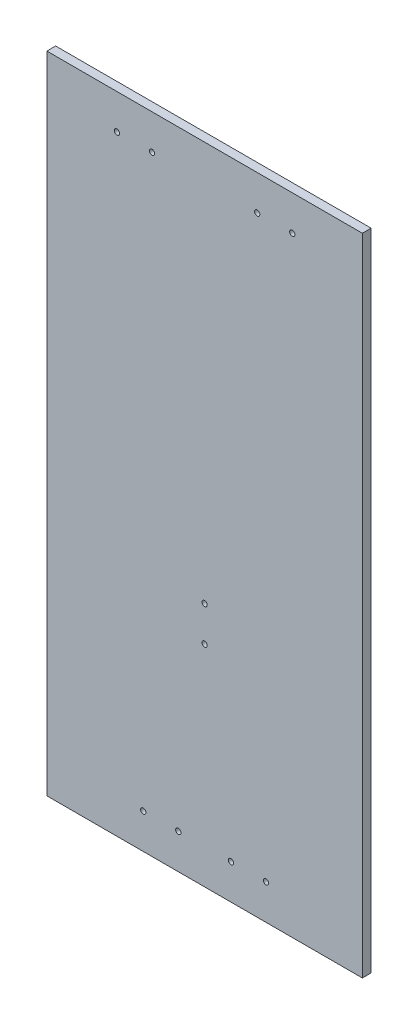
ISO-10303-21;
HEADER;
FILE_DESCRIPTION(('STEP AP214'),'2;1');
FILE_NAME('part.step','',(''),(''),'','','');
FILE_SCHEMA(('AUTOMOTIVE_DESIGN { 1 0 10303 214 1 1 1 1 }'));
ENDSEC;
DATA;
#1=APPLICATION_CONTEXT('core data for automotive mechanical design processes');
#2=APPLICATION_PROTOCOL_DEFINITION('international standard','automotive_design',2000,#1);
#3=PRODUCT_CONTEXT('',#1,'mechanical');
#4=PRODUCT('Part','Part','',(#3));
#5=PRODUCT_RELATED_PRODUCT_CATEGORY('part','',(#4));
#6=PRODUCT_DEFINITION_FORMATION('','',#4);
#7=PRODUCT_DEFINITION_CONTEXT('part definition',#1,'design');
#8=PRODUCT_DEFINITION('design','',#6,#7);
#9=PRODUCT_DEFINITION_SHAPE('','',#8);
#10=(LENGTH_UNIT() NAMED_UNIT(*) SI_UNIT(.MILLI.,.METRE.));
#11=(NAMED_UNIT(*) PLANE_ANGLE_UNIT() SI_UNIT($,.RADIAN.));
#12=(NAMED_UNIT(*) SI_UNIT($,.STERADIAN.) SOLID_ANGLE_UNIT());
#13=UNCERTAINTY_MEASURE_WITH_UNIT(LENGTH_MEASURE(1.E-05),#10,'distance_accuracy_value','');
#14=(GEOMETRIC_REPRESENTATION_CONTEXT(3) GLOBAL_UNCERTAINTY_ASSIGNED_CONTEXT((#13)) GLOBAL_UNIT_ASSIGNED_CONTEXT((#10,
#11,#12)) REPRESENTATION_CONTEXT('',''));
#15=CARTESIAN_POINT('',(0.,0.,0.));
#16=DIRECTION('',(0.,0.,1.));
#17=DIRECTION('',(1.,0.,0.));
#18=AXIS2_PLACEMENT_3D('',#15,#16,#17);
#19=CARTESIAN_POINT('',(0.,0.,5.));
#20=DIRECTION('',(0.,0.,-1.));
#21=DIRECTION('',(-1.,0.,0.));
#22=AXIS2_PLACEMENT_3D('',#19,#20,#21);
#23=PLANE('',#22);
#24=DIRECTION('',(0.,1.,0.));
#25=VECTOR('',#24,1.);
#26=CARTESIAN_POINT('',(90.,-184.,5.));
#27=LINE('',#26,#25);
#28=CARTESIAN_POINT('',(90.,-184.,5.));
#29=VERTEX_POINT('',#28);
#30=CARTESIAN_POINT('',(90.,184.,5.));
#31=VERTEX_POINT('',#30);
#32=EDGE_CURVE('E92',#29,#31,#27,.T.);
#33=ORIENTED_EDGE('',*,*,#32,.T.);
#34=DIRECTION('',(-1.,0.,0.));
#35=VECTOR('',#34,1.);
#36=CARTESIAN_POINT('',(-90.,184.,5.));
#37=LINE('',#36,#35);
#38=CARTESIAN_POINT('',(-90.,184.,5.));
#39=VERTEX_POINT('',#38);
#40=EDGE_CURVE('E87',#31,#39,#37,.T.);
#41=ORIENTED_EDGE('',*,*,#40,.T.);
#42=DIRECTION('',(0.,-1.,0.));
#43=VECTOR('',#42,1.);
#44=CARTESIAN_POINT('',(-90.,-184.,5.));
#45=LINE('',#44,#43);
#46=CARTESIAN_POINT('',(-90.,-184.,5.));
#47=VERTEX_POINT('',#46);
#48=EDGE_CURVE('E90',#39,#47,#45,.T.);
#49=ORIENTED_EDGE('',*,*,#48,.T.);
#50=DIRECTION('',(1.,0.,0.));
#51=VECTOR('',#50,1.);
#52=CARTESIAN_POINT('',(-90.,-184.,5.));
#53=LINE('',#52,#51);
#54=EDGE_CURVE('E57',#47,#29,#53,.T.);
#55=ORIENTED_EDGE('',*,*,#54,.T.);
#56=EDGE_LOOP('',(#33,#41,#49,#55));
#57=FACE_BOUND('',#56,.T.);
#58=CARTESIAN_POINT('',(15.,-164.,5.));
#59=DIRECTION('',(0.,0.,1.));
#60=DIRECTION('',(1.,0.,0.));
#61=AXIS2_PLACEMENT_3D('',#58,#59,#60);
#62=CIRCLE('',#61,1.5);
#63=CARTESIAN_POINT('',(16.5,-164.,5.));
#64=VERTEX_POINT('',#63);
#65=EDGE_CURVE('E112',#64,#64,#62,.T.);
#66=ORIENTED_EDGE('',*,*,#65,.F.);
#67=EDGE_LOOP('',(#66));
#68=FACE_BOUND('',#67,.T.);
#69=CARTESIAN_POINT('',(35.,-164.,5.));
#70=DIRECTION('',(0.,0.,1.));
#71=DIRECTION('',(1.,0.,0.));
#72=AXIS2_PLACEMENT_3D('',#69,#70,#71);
#73=CIRCLE('',#72,1.5);
#74=CARTESIAN_POINT('',(36.5,-164.,5.));
#75=VERTEX_POINT('',#74);
#76=EDGE_CURVE('E134',#75,#75,#73,.T.);
#77=ORIENTED_EDGE('',*,*,#76,.F.);
#78=EDGE_LOOP('',(#77));
#79=FACE_BOUND('',#78,.T.);
#80=CARTESIAN_POINT('',(-35.,-164.,5.));
#81=DIRECTION('',(0.,0.,1.));
#82=DIRECTION('',(-1.,0.,0.));
#83=AXIS2_PLACEMENT_3D('',#80,#81,#82);
#84=CIRCLE('',#83,1.5);
#85=CARTESIAN_POINT('',(-36.5,-164.,5.));
#86=VERTEX_POINT('',#85);
#87=EDGE_CURVE('E142',#86,#86,#84,.T.);
#88=ORIENTED_EDGE('',*,*,#87,.F.);
#89=EDGE_LOOP('',(#88));
#90=FACE_BOUND('',#89,.T.);
#91=CARTESIAN_POINT('',(-15.,-164.,5.));
#92=DIRECTION('',(0.,0.,1.));
#93=DIRECTION('',(-1.,0.,0.));
#94=AXIS2_PLACEMENT_3D('',#91,#92,#93);
#95=CIRCLE('',#94,1.5);
#96=CARTESIAN_POINT('',(-16.5,-164.,5.));
#97=VERTEX_POINT('',#96);
#98=EDGE_CURVE('E150',#97,#97,#95,.T.);
#99=ORIENTED_EDGE('',*,*,#98,.F.);
#100=EDGE_LOOP('',(#99));
#101=FACE_BOUND('',#100,.T.);
#102=CARTESIAN_POINT('',(50.,164.,5.));
#103=DIRECTION('',(0.,0.,1.));
#104=DIRECTION('',(1.,0.,0.));
#105=AXIS2_PLACEMENT_3D('',#102,#103,#104);
#106=CIRCLE('',#105,1.5);
#107=CARTESIAN_POINT('',(51.5,164.,5.));
#108=VERTEX_POINT('',#107);
#109=EDGE_CURVE('E158',#108,#108,#106,.T.);
#110=ORIENTED_EDGE('',*,*,#109,.F.);
#111=EDGE_LOOP('',(#110));
#112=FACE_BOUND('',#111,.T.);
#113=CARTESIAN_POINT('',(30.,164.,5.));
#114=DIRECTION('',(0.,0.,1.));
#115=DIRECTION('',(1.,0.,0.));
#116=AXIS2_PLACEMENT_3D('',#113,#114,#115);
#117=CIRCLE('',#116,1.5);
#118=CARTESIAN_POINT('',(31.5,164.,5.));
#119=VERTEX_POINT('',#118);
#120=EDGE_CURVE('E166',#119,#119,#117,.T.);
#121=ORIENTED_EDGE('',*,*,#120,.F.);
#122=EDGE_LOOP('',(#121));
#123=FACE_BOUND('',#122,.T.);
#124=CARTESIAN_POINT('',(0.,-63.9999999999999,5.));
#125=DIRECTION('',(0.,0.,1.));
#126=DIRECTION('',(1.,0.,0.));
#127=AXIS2_PLACEMENT_3D('',#124,#125,#126);
#128=CIRCLE('',#127,1.5);
#129=CARTESIAN_POINT('',(1.50000000000003,-63.9999999999999,5.));
#130=VERTEX_POINT('',#129);
#131=EDGE_CURVE('E174',#130,#130,#128,.T.);
#132=ORIENTED_EDGE('',*,*,#131,.F.);
#133=EDGE_LOOP('',(#132));
#134=FACE_BOUND('',#133,.T.);
#135=CARTESIAN_POINT('',(-50.,164.,5.));
#136=DIRECTION('',(0.,0.,1.));
#137=DIRECTION('',(-1.,0.,0.));
#138=AXIS2_PLACEMENT_3D('',#135,#136,#137);
#139=CIRCLE('',#138,1.5);
#140=CARTESIAN_POINT('',(-51.5,164.,5.));
#141=VERTEX_POINT('',#140);
#142=EDGE_CURVE('E182',#141,#141,#139,.T.);
#143=ORIENTED_EDGE('',*,*,#142,.F.);
#144=EDGE_LOOP('',(#143));
#145=FACE_BOUND('',#144,.T.);
#146=CARTESIAN_POINT('',(-30.,164.,5.));
#147=DIRECTION('',(0.,0.,1.));
#148=DIRECTION('',(-1.,0.,0.));
#149=AXIS2_PLACEMENT_3D('',#146,#147,#148);
#150=CIRCLE('',#149,1.5);
#151=CARTESIAN_POINT('',(-31.5,164.,5.));
#152=VERTEX_POINT('',#151);
#153=EDGE_CURVE('E190',#152,#152,#150,.T.);
#154=ORIENTED_EDGE('',*,*,#153,.F.);
#155=EDGE_LOOP('',(#154));
#156=FACE_BOUND('',#155,.T.);
#157=CARTESIAN_POINT('',(0.,-43.9999999999999,5.));
#158=DIRECTION('',(0.,0.,1.));
#159=DIRECTION('',(1.,0.,0.));
#160=AXIS2_PLACEMENT_3D('',#157,#158,#159);
#161=CIRCLE('',#160,1.5);
#162=CARTESIAN_POINT('',(1.50000000000003,-43.9999999999999,5.));
#163=VERTEX_POINT('',#162);
#164=EDGE_CURVE('E198',#163,#163,#161,.T.);
#165=ORIENTED_EDGE('',*,*,#164,.F.);
#166=EDGE_LOOP('',(#165));
#167=FACE_BOUND('',#166,.T.);
#168=ADVANCED_FACE('F39',(#57,#68,#79,#90,#101,#112,#123,#134,#145,#156,#167),#23,.F.);
#169=CARTESIAN_POINT('',(0.,0.,0.));
#170=DIRECTION('',(0.,0.,-1.));
#171=DIRECTION('',(-1.,0.,0.));
#172=AXIS2_PLACEMENT_3D('',#169,#170,#171);
#173=PLANE('',#172);
#174=CARTESIAN_POINT('',(-30.,164.,0.));
#175=DIRECTION('',(0.,0.,1.));
#176=DIRECTION('',(-1.,0.,0.));
#177=AXIS2_PLACEMENT_3D('',#174,#175,#176);
#178=CIRCLE('',#177,1.5);
#179=CARTESIAN_POINT('',(-31.5,164.,0.));
#180=VERTEX_POINT('',#179);
#181=EDGE_CURVE('E194',#180,#180,#178,.T.);
#182=ORIENTED_EDGE('',*,*,#181,.T.);
#183=EDGE_LOOP('',(#182));
#184=FACE_BOUND('',#183,.T.);
#185=CARTESIAN_POINT('',(0.,-63.9999999999999,0.));
#186=DIRECTION('',(0.,0.,1.));
#187=DIRECTION('',(1.,0.,0.));
#188=AXIS2_PLACEMENT_3D('',#185,#186,#187);
#189=CIRCLE('',#188,1.5);
#190=CARTESIAN_POINT('',(1.50000000000003,-63.9999999999999,0.));
#191=VERTEX_POINT('',#190);
#192=EDGE_CURVE('E178',#191,#191,#189,.T.);
#193=ORIENTED_EDGE('',*,*,#192,.T.);
#194=EDGE_LOOP('',(#193));
#195=FACE_BOUND('',#194,.T.);
#196=CARTESIAN_POINT('',(50.,164.,0.));
#197=DIRECTION('',(0.,0.,1.));
#198=DIRECTION('',(1.,0.,0.));
#199=AXIS2_PLACEMENT_3D('',#196,#197,#198);
#200=CIRCLE('',#199,1.5);
#201=CARTESIAN_POINT('',(51.5,164.,0.));
#202=VERTEX_POINT('',#201);
#203=EDGE_CURVE('E162',#202,#202,#200,.T.);
#204=ORIENTED_EDGE('',*,*,#203,.T.);
#205=EDGE_LOOP('',(#204));
#206=FACE_BOUND('',#205,.T.);
#207=CARTESIAN_POINT('',(-35.,-164.,0.));
#208=DIRECTION('',(0.,0.,1.));
#209=DIRECTION('',(-1.,0.,0.));
#210=AXIS2_PLACEMENT_3D('',#207,#208,#209);
#211=CIRCLE('',#210,1.5);
#212=CARTESIAN_POINT('',(-36.5,-164.,0.));
#213=VERTEX_POINT('',#212);
#214=EDGE_CURVE('E146',#213,#213,#211,.T.);
#215=ORIENTED_EDGE('',*,*,#214,.T.);
#216=EDGE_LOOP('',(#215));
#217=FACE_BOUND('',#216,.T.);
#218=CARTESIAN_POINT('',(15.,-164.,0.));
#219=DIRECTION('',(0.,0.,1.));
#220=DIRECTION('',(1.,0.,0.));
#221=AXIS2_PLACEMENT_3D('',#218,#219,#220);
#222=CIRCLE('',#221,1.5);
#223=CARTESIAN_POINT('',(16.5,-164.,0.));
#224=VERTEX_POINT('',#223);
#225=EDGE_CURVE('E130',#224,#224,#222,.T.);
#226=ORIENTED_EDGE('',*,*,#225,.T.);
#227=EDGE_LOOP('',(#226));
#228=FACE_BOUND('',#227,.T.);
#229=DIRECTION('',(0.,1.,0.));
#230=VECTOR('',#229,1.);
#231=CARTESIAN_POINT('',(90.,-184.,0.));
#232=LINE('',#231,#230);
#233=CARTESIAN_POINT('',(90.,-184.,0.));
#234=VERTEX_POINT('',#233);
#235=CARTESIAN_POINT('',(90.,184.,0.));
#236=VERTEX_POINT('',#235);
#237=EDGE_CURVE('E108',#234,#236,#232,.T.);
#238=ORIENTED_EDGE('',*,*,#237,.F.);
#239=DIRECTION('',(1.,0.,0.));
#240=VECTOR('',#239,1.);
#241=CARTESIAN_POINT('',(-90.,-184.,0.));
#242=LINE('',#241,#240);
#243=CARTESIAN_POINT('',(-90.,-184.,0.));
#244=VERTEX_POINT('',#243);
#245=EDGE_CURVE('E80',#244,#234,#242,.T.);
#246=ORIENTED_EDGE('',*,*,#245,.F.);
#247=DIRECTION('',(0.,-1.,0.));
#248=VECTOR('',#247,1.);
#249=CARTESIAN_POINT('',(-90.,-184.,0.));
#250=LINE('',#249,#248);
#251=CARTESIAN_POINT('',(-90.,184.,0.));
#252=VERTEX_POINT('',#251);
#253=EDGE_CURVE('E74',#252,#244,#250,.T.);
#254=ORIENTED_EDGE('',*,*,#253,.F.);
#255=DIRECTION('',(-1.,0.,0.));
#256=VECTOR('',#255,1.);
#257=CARTESIAN_POINT('',(-90.,184.,0.));
#258=LINE('',#257,#256);
#259=EDGE_CURVE('E97',#236,#252,#258,.T.);
#260=ORIENTED_EDGE('',*,*,#259,.F.);
#261=EDGE_LOOP('',(#238,#246,#254,#260));
#262=FACE_BOUND('',#261,.T.);
#263=CARTESIAN_POINT('',(35.,-164.,0.));
#264=DIRECTION('',(0.,0.,1.));
#265=DIRECTION('',(1.,0.,0.));
#266=AXIS2_PLACEMENT_3D('',#263,#264,#265);
#267=CIRCLE('',#266,1.5);
#268=CARTESIAN_POINT('',(36.5,-164.,0.));
#269=VERTEX_POINT('',#268);
#270=EDGE_CURVE('E138',#269,#269,#267,.T.);
#271=ORIENTED_EDGE('',*,*,#270,.T.);
#272=EDGE_LOOP('',(#271));
#273=FACE_BOUND('',#272,.T.);
#274=CARTESIAN_POINT('',(-15.,-164.,0.));
#275=DIRECTION('',(0.,0.,1.));
#276=DIRECTION('',(-1.,0.,0.));
#277=AXIS2_PLACEMENT_3D('',#274,#275,#276);
#278=CIRCLE('',#277,1.5);
#279=CARTESIAN_POINT('',(-16.5,-164.,0.));
#280=VERTEX_POINT('',#279);
#281=EDGE_CURVE('E154',#280,#280,#278,.T.);
#282=ORIENTED_EDGE('',*,*,#281,.T.);
#283=EDGE_LOOP('',(#282));
#284=FACE_BOUND('',#283,.T.);
#285=CARTESIAN_POINT('',(30.,164.,0.));
#286=DIRECTION('',(0.,0.,1.));
#287=DIRECTION('',(1.,0.,0.));
#288=AXIS2_PLACEMENT_3D('',#285,#286,#287);
#289=CIRCLE('',#288,1.5);
#290=CARTESIAN_POINT('',(31.5,164.,0.));
#291=VERTEX_POINT('',#290);
#292=EDGE_CURVE('E170',#291,#291,#289,.T.);
#293=ORIENTED_EDGE('',*,*,#292,.T.);
#294=EDGE_LOOP('',(#293));
#295=FACE_BOUND('',#294,.T.);
#296=CARTESIAN_POINT('',(-50.,164.,0.));
#297=DIRECTION('',(0.,0.,1.));
#298=DIRECTION('',(-1.,0.,0.));
#299=AXIS2_PLACEMENT_3D('',#296,#297,#298);
#300=CIRCLE('',#299,1.5);
#301=CARTESIAN_POINT('',(-51.5,164.,0.));
#302=VERTEX_POINT('',#301);
#303=EDGE_CURVE('E186',#302,#302,#300,.T.);
#304=ORIENTED_EDGE('',*,*,#303,.T.);
#305=EDGE_LOOP('',(#304));
#306=FACE_BOUND('',#305,.T.);
#307=CARTESIAN_POINT('',(0.,-43.9999999999999,0.));
#308=DIRECTION('',(0.,0.,1.));
#309=DIRECTION('',(1.,0.,0.));
#310=AXIS2_PLACEMENT_3D('',#307,#308,#309);
#311=CIRCLE('',#310,1.5);
#312=CARTESIAN_POINT('',(1.50000000000003,-43.9999999999999,0.));
#313=VERTEX_POINT('',#312);
#314=EDGE_CURVE('E202',#313,#313,#311,.T.);
#315=ORIENTED_EDGE('',*,*,#314,.T.);
#316=EDGE_LOOP('',(#315));
#317=FACE_BOUND('',#316,.T.);
#318=ADVANCED_FACE('F125',(#184,#195,#206,#217,#228,#262,#273,#284,#295,#306,#317),#173,.T.);
#319=CARTESIAN_POINT('',(90.,-184.,5.));
#320=DIRECTION('',(-1.,0.,0.));
#321=DIRECTION('',(0.,0.,1.));
#322=AXIS2_PLACEMENT_3D('',#319,#320,#321);
#323=PLANE('',#322);
#324=ORIENTED_EDGE('',*,*,#237,.T.);
#325=DIRECTION('',(0.,0.,-1.));
#326=VECTOR('',#325,1.);
#327=CARTESIAN_POINT('',(90.,184.,5.));
#328=LINE('',#327,#326);
#329=EDGE_CURVE('E11',#31,#236,#328,.T.);
#330=ORIENTED_EDGE('',*,*,#329,.F.);
#331=ORIENTED_EDGE('',*,*,#32,.F.);
#332=DIRECTION('',(0.,0.,-1.));
#333=VECTOR('',#332,1.);
#334=CARTESIAN_POINT('',(90.,-184.,5.));
#335=LINE('',#334,#333);
#336=EDGE_CURVE('E104',#29,#234,#335,.T.);
#337=ORIENTED_EDGE('',*,*,#336,.T.);
#338=EDGE_LOOP('',(#324,#330,#331,#337));
#339=FACE_BOUND('',#338,.T.);
#340=ADVANCED_FACE('F41',(#339),#323,.F.);
#341=CARTESIAN_POINT('',(-90.,184.,5.));
#342=DIRECTION('',(0.,-1.,0.));
#343=DIRECTION('',(1.,0.,0.));
#344=AXIS2_PLACEMENT_3D('',#341,#342,#343);
#345=PLANE('',#344);
#346=ORIENTED_EDGE('',*,*,#259,.T.);
#347=DIRECTION('',(0.,0.,-1.));
#348=VECTOR('',#347,1.);
#349=CARTESIAN_POINT('',(-90.,184.,5.));
#350=LINE('',#349,#348);
#351=EDGE_CURVE('E49',#39,#252,#350,.T.);
#352=ORIENTED_EDGE('',*,*,#351,.F.);
#353=ORIENTED_EDGE('',*,*,#40,.F.);
#354=ORIENTED_EDGE('',*,*,#329,.T.);
#355=EDGE_LOOP('',(#346,#352,#353,#354));
#356=FACE_BOUND('',#355,.T.);
#357=ADVANCED_FACE('F96',(#356),#345,.F.);
#358=CARTESIAN_POINT('',(-90.,-184.,5.));
#359=DIRECTION('',(1.,0.,0.));
#360=DIRECTION('',(0.,1.,0.));
#361=AXIS2_PLACEMENT_3D('',#358,#359,#360);
#362=PLANE('',#361);
#363=ORIENTED_EDGE('',*,*,#253,.T.);
#364=DIRECTION('',(0.,0.,-1.));
#365=VECTOR('',#364,1.);
#366=CARTESIAN_POINT('',(-90.,-184.,5.));
#367=LINE('',#366,#365);
#368=EDGE_CURVE('E99',#47,#244,#367,.T.);
#369=ORIENTED_EDGE('',*,*,#368,.F.);
#370=ORIENTED_EDGE('',*,*,#48,.F.);
#371=ORIENTED_EDGE('',*,*,#351,.T.);
#372=EDGE_LOOP('',(#363,#369,#370,#371));
#373=FACE_BOUND('',#372,.T.);
#374=ADVANCED_FACE('F100',(#373),#362,.F.);
#375=CARTESIAN_POINT('',(-90.,-184.,5.));
#376=DIRECTION('',(0.,1.,0.));
#377=DIRECTION('',(-1.,0.,0.));
#378=AXIS2_PLACEMENT_3D('',#375,#376,#377);
#379=PLANE('',#378);
#380=ORIENTED_EDGE('',*,*,#245,.T.);
#381=ORIENTED_EDGE('',*,*,#336,.F.);
#382=ORIENTED_EDGE('',*,*,#54,.F.);
#383=ORIENTED_EDGE('',*,*,#368,.T.);
#384=EDGE_LOOP('',(#380,#381,#382,#383));
#385=FACE_BOUND('',#384,.T.);
#386=ADVANCED_FACE('F122',(#385),#379,.F.);
#387=CARTESIAN_POINT('',(15.,-164.,5.));
#388=DIRECTION('',(0.,0.,-1.));
#389=DIRECTION('',(-1.,0.,0.));
#390=AXIS2_PLACEMENT_3D('',#387,#388,#389);
#391=CYLINDRICAL_SURFACE('',#390,1.5);
#392=ORIENTED_EDGE('',*,*,#65,.T.);
#393=EDGE_LOOP('',(#392));
#394=FACE_BOUND('',#393,.T.);
#395=ORIENTED_EDGE('',*,*,#225,.F.);
#396=EDGE_LOOP('',(#395));
#397=FACE_BOUND('',#396,.T.);
#398=ADVANCED_FACE('F221',(#394,#397),#391,.F.);
#399=CARTESIAN_POINT('',(35.,-164.,5.));
#400=DIRECTION('',(0.,0.,-1.));
#401=DIRECTION('',(-1.,0.,0.));
#402=AXIS2_PLACEMENT_3D('',#399,#400,#401);
#403=CYLINDRICAL_SURFACE('',#402,1.5);
#404=ORIENTED_EDGE('',*,*,#76,.T.);
#405=EDGE_LOOP('',(#404));
#406=FACE_BOUND('',#405,.T.);
#407=ORIENTED_EDGE('',*,*,#270,.F.);
#408=EDGE_LOOP('',(#407));
#409=FACE_BOUND('',#408,.T.);
#410=ADVANCED_FACE('F267',(#406,#409),#403,.F.);
#411=CARTESIAN_POINT('',(-35.,-164.,5.));
#412=DIRECTION('',(0.,0.,-1.));
#413=DIRECTION('',(-1.,0.,0.));
#414=AXIS2_PLACEMENT_3D('',#411,#412,#413);
#415=CYLINDRICAL_SURFACE('',#414,1.5);
#416=ORIENTED_EDGE('',*,*,#87,.T.);
#417=EDGE_LOOP('',(#416));
#418=FACE_BOUND('',#417,.T.);
#419=ORIENTED_EDGE('',*,*,#214,.F.);
#420=EDGE_LOOP('',(#419));
#421=FACE_BOUND('',#420,.T.);
#422=ADVANCED_FACE('F275',(#418,#421),#415,.F.);
#423=CARTESIAN_POINT('',(-15.,-164.,5.));
#424=DIRECTION('',(0.,0.,-1.));
#425=DIRECTION('',(-1.,0.,0.));
#426=AXIS2_PLACEMENT_3D('',#423,#424,#425);
#427=CYLINDRICAL_SURFACE('',#426,1.5);
#428=ORIENTED_EDGE('',*,*,#98,.T.);
#429=EDGE_LOOP('',(#428));
#430=FACE_BOUND('',#429,.T.);
#431=ORIENTED_EDGE('',*,*,#281,.F.);
#432=EDGE_LOOP('',(#431));
#433=FACE_BOUND('',#432,.T.);
#434=ADVANCED_FACE('F283',(#430,#433),#427,.F.);
#435=CARTESIAN_POINT('',(50.,164.,5.));
#436=DIRECTION('',(0.,0.,-1.));
#437=DIRECTION('',(-1.,0.,0.));
#438=AXIS2_PLACEMENT_3D('',#435,#436,#437);
#439=CYLINDRICAL_SURFACE('',#438,1.5);
#440=ORIENTED_EDGE('',*,*,#109,.T.);
#441=EDGE_LOOP('',(#440));
#442=FACE_BOUND('',#441,.T.);
#443=ORIENTED_EDGE('',*,*,#203,.F.);
#444=EDGE_LOOP('',(#443));
#445=FACE_BOUND('',#444,.T.);
#446=ADVANCED_FACE('F292',(#442,#445),#439,.F.);
#447=CARTESIAN_POINT('',(30.,164.,5.));
#448=DIRECTION('',(0.,0.,-1.));
#449=DIRECTION('',(-1.,0.,0.));
#450=AXIS2_PLACEMENT_3D('',#447,#448,#449);
#451=CYLINDRICAL_SURFACE('',#450,1.5);
#452=ORIENTED_EDGE('',*,*,#120,.T.);
#453=EDGE_LOOP('',(#452));
#454=FACE_BOUND('',#453,.T.);
#455=ORIENTED_EDGE('',*,*,#292,.F.);
#456=EDGE_LOOP('',(#455));
#457=FACE_BOUND('',#456,.T.);
#458=ADVANCED_FACE('F301',(#454,#457),#451,.F.);
#459=CARTESIAN_POINT('',(0.,-63.9999999999999,5.));
#460=DIRECTION('',(0.,0.,-1.));
#461=DIRECTION('',(-1.,0.,0.));
#462=AXIS2_PLACEMENT_3D('',#459,#460,#461);
#463=CYLINDRICAL_SURFACE('',#462,1.5);
#464=ORIENTED_EDGE('',*,*,#131,.T.);
#465=EDGE_LOOP('',(#464));
#466=FACE_BOUND('',#465,.T.);
#467=ORIENTED_EDGE('',*,*,#192,.F.);
#468=EDGE_LOOP('',(#467));
#469=FACE_BOUND('',#468,.T.);
#470=ADVANCED_FACE('F310',(#466,#469),#463,.F.);
#471=CARTESIAN_POINT('',(-50.,164.,5.));
#472=DIRECTION('',(0.,0.,-1.));
#473=DIRECTION('',(-1.,0.,0.));
#474=AXIS2_PLACEMENT_3D('',#471,#472,#473);
#475=CYLINDRICAL_SURFACE('',#474,1.5);
#476=ORIENTED_EDGE('',*,*,#142,.T.);
#477=EDGE_LOOP('',(#476));
#478=FACE_BOUND('',#477,.T.);
#479=ORIENTED_EDGE('',*,*,#303,.F.);
#480=EDGE_LOOP('',(#479));
#481=FACE_BOUND('',#480,.T.);
#482=ADVANCED_FACE('F319',(#478,#481),#475,.F.);
#483=CARTESIAN_POINT('',(-30.,164.,5.));
#484=DIRECTION('',(0.,0.,-1.));
#485=DIRECTION('',(-1.,0.,0.));
#486=AXIS2_PLACEMENT_3D('',#483,#484,#485);
#487=CYLINDRICAL_SURFACE('',#486,1.5);
#488=ORIENTED_EDGE('',*,*,#153,.T.);
#489=EDGE_LOOP('',(#488));
#490=FACE_BOUND('',#489,.T.);
#491=ORIENTED_EDGE('',*,*,#181,.F.);
#492=EDGE_LOOP('',(#491));
#493=FACE_BOUND('',#492,.T.);
#494=ADVANCED_FACE('F328',(#490,#493),#487,.F.);
#495=CARTESIAN_POINT('',(0.,-43.9999999999999,5.));
#496=DIRECTION('',(0.,0.,-1.));
#497=DIRECTION('',(-1.,0.,0.));
#498=AXIS2_PLACEMENT_3D('',#495,#496,#497);
#499=CYLINDRICAL_SURFACE('',#498,1.5);
#500=ORIENTED_EDGE('',*,*,#164,.T.);
#501=EDGE_LOOP('',(#500));
#502=FACE_BOUND('',#501,.T.);
#503=ORIENTED_EDGE('',*,*,#314,.F.);
#504=EDGE_LOOP('',(#503));
#505=FACE_BOUND('',#504,.T.);
#506=ADVANCED_FACE('F210',(#502,#505),#499,.F.);
#507=CLOSED_SHELL('',(#168,#318,#340,#357,#374,#386,#398,#410,#422,#434,#446,#458,#470,#482,
#494,#506));
#508=MANIFOLD_SOLID_BREP('B2',#507);
#509=ADVANCED_BREP_SHAPE_REPRESENTATION('',(#18,#508),#14);
#510=SHAPE_DEFINITION_REPRESENTATION(#9,#509);
ENDSEC;
END-ISO-10303-21;
